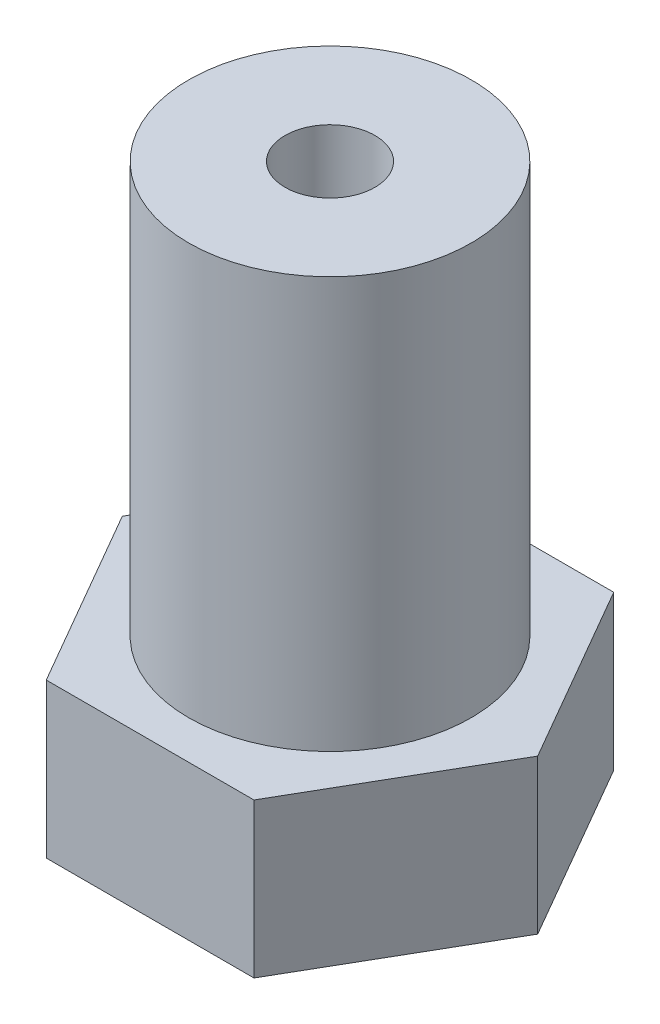
ISO-10303-21;
HEADER;
FILE_DESCRIPTION(('STEP AP214'),'2;1');
FILE_NAME('part.step','',(''),(''),'','','');
FILE_SCHEMA(('AUTOMOTIVE_DESIGN { 1 0 10303 214 1 1 1 1 }'));
ENDSEC;
DATA;
#1=APPLICATION_CONTEXT('core data for automotive mechanical design processes');
#2=APPLICATION_PROTOCOL_DEFINITION('international standard','automotive_design',2000,#1);
#3=PRODUCT_CONTEXT('',#1,'mechanical');
#4=PRODUCT('Part','Part','',(#3));
#5=PRODUCT_RELATED_PRODUCT_CATEGORY('part','',(#4));
#6=PRODUCT_DEFINITION_FORMATION('','',#4);
#7=PRODUCT_DEFINITION_CONTEXT('part definition',#1,'design');
#8=PRODUCT_DEFINITION('design','',#6,#7);
#9=PRODUCT_DEFINITION_SHAPE('','',#8);
#10=(LENGTH_UNIT() NAMED_UNIT(*) SI_UNIT(.MILLI.,.METRE.));
#11=(NAMED_UNIT(*) PLANE_ANGLE_UNIT() SI_UNIT($,.RADIAN.));
#12=(NAMED_UNIT(*) SI_UNIT($,.STERADIAN.) SOLID_ANGLE_UNIT());
#13=UNCERTAINTY_MEASURE_WITH_UNIT(LENGTH_MEASURE(1.E-05),#10,'distance_accuracy_value','');
#14=(GEOMETRIC_REPRESENTATION_CONTEXT(3) GLOBAL_UNCERTAINTY_ASSIGNED_CONTEXT((#13)) GLOBAL_UNIT_ASSIGNED_CONTEXT((#10,
#11,#12)) REPRESENTATION_CONTEXT('',''));
#15=CARTESIAN_POINT('',(0.,0.,0.));
#16=DIRECTION('',(0.,0.,1.));
#17=DIRECTION('',(1.,0.,0.));
#18=AXIS2_PLACEMENT_3D('',#15,#16,#17);
#19=CARTESIAN_POINT('',(0.,6.,0.));
#20=DIRECTION('',(0.,1.,0.));
#21=DIRECTION('',(0.,0.,1.));
#22=AXIS2_PLACEMENT_3D('',#19,#20,#21);
#23=PLANE('',#22);
#24=DIRECTION('',(0.499999999999999,0.,-0.866025403784439));
#25=VECTOR('',#24,1.);
#26=CARTESIAN_POINT('',(4.04145188432738,6.,7.00000000000001));
#27=LINE('',#26,#25);
#28=CARTESIAN_POINT('',(4.04145188432738,6.,7.00000000000001));
#29=VERTEX_POINT('',#28);
#30=CARTESIAN_POINT('',(8.08290376865476,6.,0.));
#31=VERTEX_POINT('',#30);
#32=EDGE_CURVE('E130',#29,#31,#27,.T.);
#33=ORIENTED_EDGE('',*,*,#32,.T.);
#34=DIRECTION('',(-0.5,0.,-0.866025403784439));
#35=VECTOR('',#34,1.);
#36=CARTESIAN_POINT('',(8.08290376865476,6.,0.));
#37=LINE('',#36,#35);
#38=CARTESIAN_POINT('',(4.04145188432737,6.,-7.00000000000002));
#39=VERTEX_POINT('',#38);
#40=EDGE_CURVE('E88',#31,#39,#37,.T.);
#41=ORIENTED_EDGE('',*,*,#40,.T.);
#42=DIRECTION('',(-1.,0.,0.));
#43=VECTOR('',#42,1.);
#44=CARTESIAN_POINT('',(4.04145188432737,6.,-7.00000000000002));
#45=LINE('',#44,#43);
#46=CARTESIAN_POINT('',(-4.04145188432738,6.,-7.00000000000002));
#47=VERTEX_POINT('',#46);
#48=EDGE_CURVE('E101',#39,#47,#45,.T.);
#49=ORIENTED_EDGE('',*,*,#48,.T.);
#50=DIRECTION('',(-0.5,0.,0.866025403784439));
#51=VECTOR('',#50,1.);
#52=CARTESIAN_POINT('',(-4.04145188432738,6.,-7.00000000000002));
#53=LINE('',#52,#51);
#54=CARTESIAN_POINT('',(-8.08290376865477,6.,0.));
#55=VERTEX_POINT('',#54);
#56=EDGE_CURVE('E95',#47,#55,#53,.T.);
#57=ORIENTED_EDGE('',*,*,#56,.T.);
#58=DIRECTION('',(0.5,0.,0.866025403784438));
#59=VECTOR('',#58,1.);
#60=CARTESIAN_POINT('',(-8.08290376865477,6.,0.));
#61=LINE('',#60,#59);
#62=CARTESIAN_POINT('',(-4.04145188432739,6.,7.00000000000001));
#63=VERTEX_POINT('',#62);
#64=EDGE_CURVE('E99',#55,#63,#61,.T.);
#65=ORIENTED_EDGE('',*,*,#64,.T.);
#66=DIRECTION('',(1.,0.,0.));
#67=VECTOR('',#66,1.);
#68=CARTESIAN_POINT('',(-4.04145188432739,6.,7.00000000000001));
#69=LINE('',#68,#67);
#70=EDGE_CURVE('E50',#63,#29,#69,.T.);
#71=ORIENTED_EDGE('',*,*,#70,.T.);
#72=EDGE_LOOP('',(#33,#41,#49,#57,#65,#71));
#73=FACE_BOUND('',#72,.T.);
#74=CARTESIAN_POINT('',(0.,6.,0.));
#75=DIRECTION('',(0.,1.,0.));
#76=DIRECTION('',(0.,0.,1.));
#77=AXIS2_PLACEMENT_3D('',#74,#75,#76);
#78=CIRCLE('',#77,5.5);
#79=CARTESIAN_POINT('',(0.,6.,5.5));
#80=VERTEX_POINT('',#79);
#81=EDGE_CURVE('E149',#80,#80,#78,.T.);
#82=ORIENTED_EDGE('',*,*,#81,.F.);
#83=EDGE_LOOP('',(#82));
#84=FACE_BOUND('',#83,.T.);
#85=ADVANCED_FACE('F33',(#73,#84),#23,.T.);
#86=CARTESIAN_POINT('',(4.04145188432738,6.,7.00000000000001));
#87=DIRECTION('',(-0.866025403784439,0.,-0.499999999999999));
#88=DIRECTION('',(-0.499999999999999,0.,0.866025403784439));
#89=AXIS2_PLACEMENT_3D('',#86,#87,#88);
#90=PLANE('',#89);
#91=DIRECTION('',(0.499999999999999,0.,-0.866025403784439));
#92=VECTOR('',#91,1.);
#93=CARTESIAN_POINT('',(4.04145188432738,0.,7.00000000000001));
#94=LINE('',#93,#92);
#95=CARTESIAN_POINT('',(4.04145188432738,0.,7.00000000000001));
#96=VERTEX_POINT('',#95);
#97=CARTESIAN_POINT('',(8.08290376865476,0.,0.));
#98=VERTEX_POINT('',#97);
#99=EDGE_CURVE('E119',#96,#98,#94,.T.);
#100=ORIENTED_EDGE('',*,*,#99,.T.);
#101=DIRECTION('',(0.,-1.,0.));
#102=VECTOR('',#101,1.);
#103=CARTESIAN_POINT('',(8.08290376865476,6.,0.));
#104=LINE('',#103,#102);
#105=EDGE_CURVE('E42',#31,#98,#104,.T.);
#106=ORIENTED_EDGE('',*,*,#105,.F.);
#107=ORIENTED_EDGE('',*,*,#32,.F.);
#108=DIRECTION('',(0.,-1.,0.));
#109=VECTOR('',#108,1.);
#110=CARTESIAN_POINT('',(4.04145188432738,6.,7.00000000000001));
#111=LINE('',#110,#109);
#112=EDGE_CURVE('E115',#29,#96,#111,.T.);
#113=ORIENTED_EDGE('',*,*,#112,.T.);
#114=EDGE_LOOP('',(#100,#106,#107,#113));
#115=FACE_BOUND('',#114,.T.);
#116=ADVANCED_FACE('F35',(#115),#90,.F.);
#117=CARTESIAN_POINT('',(8.08290376865476,6.,0.));
#118=DIRECTION('',(-0.866025403784439,0.,0.5));
#119=DIRECTION('',(0.5,0.,0.866025403784439));
#120=AXIS2_PLACEMENT_3D('',#117,#118,#119);
#121=PLANE('',#120);
#122=DIRECTION('',(-0.5,0.,-0.866025403784439));
#123=VECTOR('',#122,1.);
#124=CARTESIAN_POINT('',(8.08290376865476,0.,0.));
#125=LINE('',#124,#123);
#126=CARTESIAN_POINT('',(4.04145188432737,0.,-7.00000000000002));
#127=VERTEX_POINT('',#126);
#128=EDGE_CURVE('E122',#98,#127,#125,.T.);
#129=ORIENTED_EDGE('',*,*,#128,.T.);
#130=DIRECTION('',(0.,-1.,0.));
#131=VECTOR('',#130,1.);
#132=CARTESIAN_POINT('',(4.04145188432737,6.,-7.00000000000002));
#133=LINE('',#132,#131);
#134=EDGE_CURVE('E134',#39,#127,#133,.T.);
#135=ORIENTED_EDGE('',*,*,#134,.F.);
#136=ORIENTED_EDGE('',*,*,#40,.F.);
#137=ORIENTED_EDGE('',*,*,#105,.T.);
#138=EDGE_LOOP('',(#129,#135,#136,#137));
#139=FACE_BOUND('',#138,.T.);
#140=ADVANCED_FACE('F137',(#139),#121,.F.);
#141=CARTESIAN_POINT('',(4.04145188432737,6.,-7.00000000000002));
#142=DIRECTION('',(0.,0.,1.));
#143=DIRECTION('',(1.,0.,0.));
#144=AXIS2_PLACEMENT_3D('',#141,#142,#143);
#145=PLANE('',#144);
#146=DIRECTION('',(-1.,0.,0.));
#147=VECTOR('',#146,1.);
#148=CARTESIAN_POINT('',(4.04145188432737,0.,-7.00000000000002));
#149=LINE('',#148,#147);
#150=CARTESIAN_POINT('',(-4.04145188432738,0.,-7.00000000000002));
#151=VERTEX_POINT('',#150);
#152=EDGE_CURVE('E125',#127,#151,#149,.T.);
#153=ORIENTED_EDGE('',*,*,#152,.T.);
#154=DIRECTION('',(0.,-1.,0.));
#155=VECTOR('',#154,1.);
#156=CARTESIAN_POINT('',(-4.04145188432738,6.,-7.00000000000002));
#157=LINE('',#156,#155);
#158=EDGE_CURVE('E110',#47,#151,#157,.T.);
#159=ORIENTED_EDGE('',*,*,#158,.F.);
#160=ORIENTED_EDGE('',*,*,#48,.F.);
#161=ORIENTED_EDGE('',*,*,#134,.T.);
#162=EDGE_LOOP('',(#153,#159,#160,#161));
#163=FACE_BOUND('',#162,.T.);
#164=ADVANCED_FACE('F145',(#163),#145,.F.);
#165=CARTESIAN_POINT('',(-4.04145188432738,6.,-7.00000000000002));
#166=DIRECTION('',(0.866025403784439,0.,0.5));
#167=DIRECTION('',(0.5,0.,-0.866025403784439));
#168=AXIS2_PLACEMENT_3D('',#165,#166,#167);
#169=PLANE('',#168);
#170=DIRECTION('',(-0.5,0.,0.866025403784439));
#171=VECTOR('',#170,1.);
#172=CARTESIAN_POINT('',(-4.04145188432738,0.,-7.00000000000002));
#173=LINE('',#172,#171);
#174=CARTESIAN_POINT('',(-8.08290376865477,0.,0.));
#175=VERTEX_POINT('',#174);
#176=EDGE_CURVE('E109',#151,#175,#173,.T.);
#177=ORIENTED_EDGE('',*,*,#176,.T.);
#178=DIRECTION('',(0.,-1.,0.));
#179=VECTOR('',#178,1.);
#180=CARTESIAN_POINT('',(-8.08290376865477,6.,0.));
#181=LINE('',#180,#179);
#182=EDGE_CURVE('E106',#55,#175,#181,.T.);
#183=ORIENTED_EDGE('',*,*,#182,.F.);
#184=ORIENTED_EDGE('',*,*,#56,.F.);
#185=ORIENTED_EDGE('',*,*,#158,.T.);
#186=EDGE_LOOP('',(#177,#183,#184,#185));
#187=FACE_BOUND('',#186,.T.);
#188=ADVANCED_FACE('F107',(#187),#169,.F.);
#189=CARTESIAN_POINT('',(-8.08290376865477,6.,0.));
#190=DIRECTION('',(0.866025403784438,0.,-0.5));
#191=DIRECTION('',(-0.5,0.,-0.866025403784438));
#192=AXIS2_PLACEMENT_3D('',#189,#190,#191);
#193=PLANE('',#192);
#194=DIRECTION('',(0.5,0.,0.866025403784438));
#195=VECTOR('',#194,1.);
#196=CARTESIAN_POINT('',(-8.08290376865477,0.,0.));
#197=LINE('',#196,#195);
#198=CARTESIAN_POINT('',(-4.04145188432739,0.,7.00000000000001));
#199=VERTEX_POINT('',#198);
#200=EDGE_CURVE('E73',#175,#199,#197,.T.);
#201=ORIENTED_EDGE('',*,*,#200,.T.);
#202=DIRECTION('',(0.,-1.,0.));
#203=VECTOR('',#202,1.);
#204=CARTESIAN_POINT('',(-4.04145188432739,6.,7.00000000000001));
#205=LINE('',#204,#203);
#206=EDGE_CURVE('E111',#63,#199,#205,.T.);
#207=ORIENTED_EDGE('',*,*,#206,.F.);
#208=ORIENTED_EDGE('',*,*,#64,.F.);
#209=ORIENTED_EDGE('',*,*,#182,.T.);
#210=EDGE_LOOP('',(#201,#207,#208,#209));
#211=FACE_BOUND('',#210,.T.);
#212=ADVANCED_FACE('F113',(#211),#193,.F.);
#213=CARTESIAN_POINT('',(-4.04145188432739,6.,7.00000000000001));
#214=DIRECTION('',(0.,0.,-1.));
#215=DIRECTION('',(-1.,0.,0.));
#216=AXIS2_PLACEMENT_3D('',#213,#214,#215);
#217=PLANE('',#216);
#218=DIRECTION('',(1.,0.,0.));
#219=VECTOR('',#218,1.);
#220=CARTESIAN_POINT('',(-4.04145188432739,0.,7.00000000000001));
#221=LINE('',#220,#219);
#222=EDGE_CURVE('E79',#199,#96,#221,.T.);
#223=ORIENTED_EDGE('',*,*,#222,.T.);
#224=ORIENTED_EDGE('',*,*,#112,.F.);
#225=ORIENTED_EDGE('',*,*,#70,.F.);
#226=ORIENTED_EDGE('',*,*,#206,.T.);
#227=EDGE_LOOP('',(#223,#224,#225,#226));
#228=FACE_BOUND('',#227,.T.);
#229=ADVANCED_FACE('F172',(#228),#217,.F.);
#230=CARTESIAN_POINT('',(0.,0.,0.));
#231=DIRECTION('',(0.,1.,0.));
#232=DIRECTION('',(0.,0.,1.));
#233=AXIS2_PLACEMENT_3D('',#230,#231,#232);
#234=PLANE('',#233);
#235=ORIENTED_EDGE('',*,*,#99,.F.);
#236=ORIENTED_EDGE('',*,*,#222,.F.);
#237=ORIENTED_EDGE('',*,*,#200,.F.);
#238=ORIENTED_EDGE('',*,*,#176,.F.);
#239=ORIENTED_EDGE('',*,*,#152,.F.);
#240=ORIENTED_EDGE('',*,*,#128,.F.);
#241=EDGE_LOOP('',(#235,#236,#237,#238,#239,#240));
#242=FACE_BOUND('',#241,.T.);
#243=ADVANCED_FACE('F142',(#242),#234,.F.);
#244=CARTESIAN_POINT('',(0.,22.,0.));
#245=DIRECTION('',(0.,1.,0.));
#246=DIRECTION('',(0.,0.,1.));
#247=AXIS2_PLACEMENT_3D('',#244,#245,#246);
#248=PLANE('',#247);
#249=CARTESIAN_POINT('',(0.,22.,0.));
#250=DIRECTION('',(0.,1.,0.));
#251=DIRECTION('',(0.,0.,1.));
#252=AXIS2_PLACEMENT_3D('',#249,#250,#251);
#253=CIRCLE('',#252,5.5);
#254=CARTESIAN_POINT('',(0.,22.,5.5));
#255=VERTEX_POINT('',#254);
#256=EDGE_CURVE('E123',#255,#255,#253,.T.);
#257=ORIENTED_EDGE('',*,*,#256,.T.);
#258=EDGE_LOOP('',(#257));
#259=FACE_BOUND('',#258,.T.);
#260=CARTESIAN_POINT('',(0.,22.,0.));
#261=DIRECTION('',(0.,1.,0.));
#262=DIRECTION('',(0.,0.,1.));
#263=AXIS2_PLACEMENT_3D('',#260,#261,#262);
#264=CIRCLE('',#263,1.75);
#265=CARTESIAN_POINT('',(0.,22.,1.75));
#266=VERTEX_POINT('',#265);
#267=EDGE_CURVE('E152',#266,#266,#264,.T.);
#268=ORIENTED_EDGE('',*,*,#267,.F.);
#269=EDGE_LOOP('',(#268));
#270=FACE_BOUND('',#269,.T.);
#271=ADVANCED_FACE('F161',(#259,#270),#248,.T.);
#272=CARTESIAN_POINT('',(0.,22.,0.));
#273=DIRECTION('',(0.,-1.,0.));
#274=DIRECTION('',(0.,0.,-1.));
#275=AXIS2_PLACEMENT_3D('',#272,#273,#274);
#276=CYLINDRICAL_SURFACE('',#275,5.5);
#277=ORIENTED_EDGE('',*,*,#256,.F.);
#278=EDGE_LOOP('',(#277));
#279=FACE_BOUND('',#278,.T.);
#280=ORIENTED_EDGE('',*,*,#81,.T.);
#281=EDGE_LOOP('',(#280));
#282=FACE_BOUND('',#281,.T.);
#283=ADVANCED_FACE('F163',(#279,#282),#276,.T.);
#284=CARTESIAN_POINT('',(0.,22.,0.));
#285=DIRECTION('',(0.,-1.,0.));
#286=DIRECTION('',(0.,0.,-1.));
#287=AXIS2_PLACEMENT_3D('',#284,#285,#286);
#288=CYLINDRICAL_SURFACE('',#287,1.75);
#289=ORIENTED_EDGE('',*,*,#267,.T.);
#290=EDGE_LOOP('',(#289));
#291=FACE_BOUND('',#290,.T.);
#292=CARTESIAN_POINT('',(0.,6.,0.));
#293=DIRECTION('',(0.,1.,0.));
#294=DIRECTION('',(0.,0.,1.));
#295=AXIS2_PLACEMENT_3D('',#292,#293,#294);
#296=CIRCLE('',#295,1.75);
#297=CARTESIAN_POINT('',(0.,6.,1.75));
#298=VERTEX_POINT('',#297);
#299=EDGE_CURVE('E11',#298,#298,#296,.F.);
#300=ORIENTED_EDGE('',*,*,#299,.T.);
#301=EDGE_LOOP('',(#300));
#302=FACE_BOUND('',#301,.T.);
#303=ADVANCED_FACE('F158',(#291,#302),#288,.F.);
#304=ORIENTED_EDGE('',*,*,#299,.F.);
#305=EDGE_LOOP('',(#304));
#306=FACE_BOUND('',#305,.T.);
#307=ADVANCED_FACE('F177',(#306),#23,.T.);
#308=CLOSED_SHELL('',(#85,#116,#140,#164,#188,#212,#229,#243,#271,#283,#303,#307));
#309=MANIFOLD_SOLID_BREP('B2',#308);
#310=ADVANCED_BREP_SHAPE_REPRESENTATION('',(#18,#309),#14);
#311=SHAPE_DEFINITION_REPRESENTATION(#9,#310);
ENDSEC;
END-ISO-10303-21;
